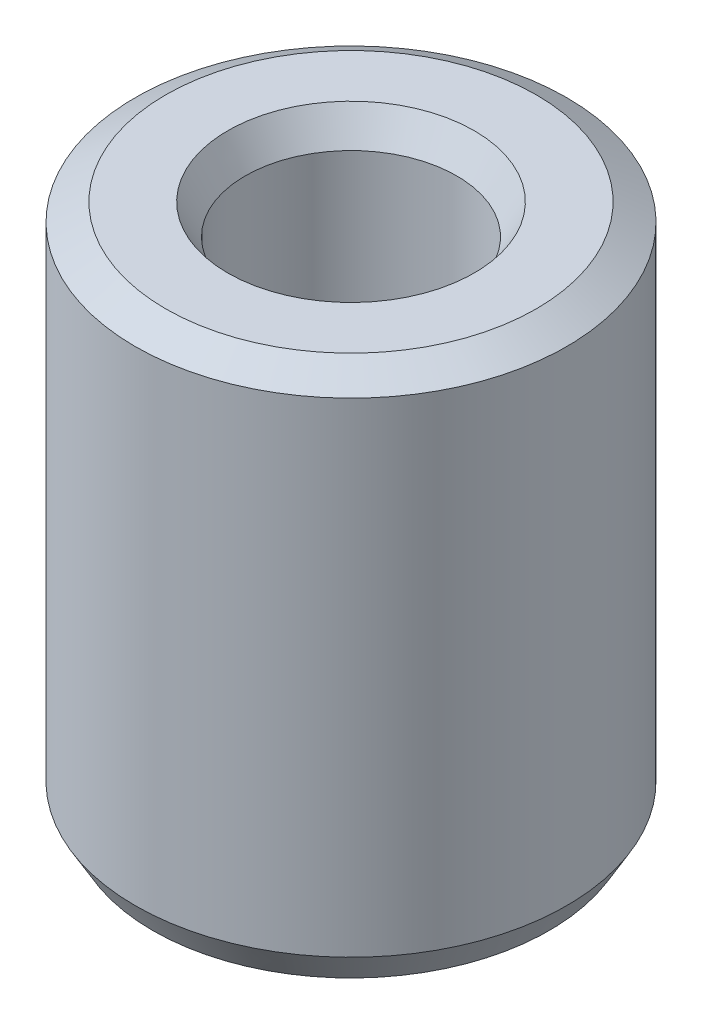
ISO-10303-21;
HEADER;
FILE_DESCRIPTION(('STEP AP214'),'2;1');
FILE_NAME('part.step','',(''),(''),'','','');
FILE_SCHEMA(('AUTOMOTIVE_DESIGN { 1 0 10303 214 1 1 1 1 }'));
ENDSEC;
DATA;
#1=APPLICATION_CONTEXT('core data for automotive mechanical design processes');
#2=APPLICATION_PROTOCOL_DEFINITION('international standard','automotive_design',2000,#1);
#3=PRODUCT_CONTEXT('',#1,'mechanical');
#4=PRODUCT('Part','Part','',(#3));
#5=PRODUCT_RELATED_PRODUCT_CATEGORY('part','',(#4));
#6=PRODUCT_DEFINITION_FORMATION('','',#4);
#7=PRODUCT_DEFINITION_CONTEXT('part definition',#1,'design');
#8=PRODUCT_DEFINITION('design','',#6,#7);
#9=PRODUCT_DEFINITION_SHAPE('','',#8);
#10=(LENGTH_UNIT() NAMED_UNIT(*) SI_UNIT(.MILLI.,.METRE.));
#11=(NAMED_UNIT(*) PLANE_ANGLE_UNIT() SI_UNIT($,.RADIAN.));
#12=(NAMED_UNIT(*) SI_UNIT($,.STERADIAN.) SOLID_ANGLE_UNIT());
#13=UNCERTAINTY_MEASURE_WITH_UNIT(LENGTH_MEASURE(1.E-05),#10,'distance_accuracy_value','');
#14=(GEOMETRIC_REPRESENTATION_CONTEXT(3) GLOBAL_UNCERTAINTY_ASSIGNED_CONTEXT((#13)) GLOBAL_UNIT_ASSIGNED_CONTEXT((#10,
#11,#12)) REPRESENTATION_CONTEXT('',''));
#15=CARTESIAN_POINT('',(0.,0.,0.));
#16=DIRECTION('',(0.,0.,1.));
#17=DIRECTION('',(1.,0.,0.));
#18=AXIS2_PLACEMENT_3D('',#15,#16,#17);
#19=CARTESIAN_POINT('',(0.,74.0065154047486,0.));
#20=DIRECTION('',(0.,-1.,0.));
#21=DIRECTION('',(0.,0.,-1.));
#22=AXIS2_PLACEMENT_3D('',#19,#20,#21);
#23=CYLINDRICAL_SURFACE('',#22,30.);
#24=CARTESIAN_POINT('',(0.,4.22138950589247,0.));
#25=DIRECTION('',(0.,1.,0.));
#26=DIRECTION('',(0.,0.,1.));
#27=AXIS2_PLACEMENT_3D('',#24,#25,#26);
#28=CIRCLE('',#27,30.);
#29=CARTESIAN_POINT('',(0.,4.22138950589247,30.));
#30=VERTEX_POINT('',#29);
#31=EDGE_CURVE('E10',#30,#30,#28,.T.);
#32=ORIENTED_EDGE('',*,*,#31,.T.);
#33=EDGE_LOOP('',(#32));
#34=FACE_BOUND('',#33,.T.);
#35=CARTESIAN_POINT('',(0.,71.5692950371673,0.));
#36=DIRECTION('',(0.,1.,0.));
#37=DIRECTION('',(0.,0.,1.));
#38=AXIS2_PLACEMENT_3D('',#35,#36,#37);
#39=CIRCLE('',#38,30.);
#40=CARTESIAN_POINT('',(0.,71.5692950371673,-30.));
#41=VERTEX_POINT('',#40);
#42=EDGE_CURVE('E50',#41,#41,#39,.F.);
#43=ORIENTED_EDGE('',*,*,#42,.T.);
#44=EDGE_LOOP('',(#43));
#45=FACE_BOUND('',#44,.T.);
#46=ADVANCED_FACE('F39',(#34,#45),#23,.T.);
#47=CARTESIAN_POINT('',(0.,74.0065154047486,0.));
#48=DIRECTION('',(0.,1.,0.));
#49=DIRECTION('',(0.,0.,1.));
#50=AXIS2_PLACEMENT_3D('',#47,#48,#49);
#51=PLANE('',#50);
#52=CARTESIAN_POINT('',(0.,74.0065154047486,0.));
#53=DIRECTION('',(0.,1.,0.));
#54=DIRECTION('',(0.,0.,1.));
#55=AXIS2_PLACEMENT_3D('',#52,#53,#54);
#56=CIRCLE('',#55,17.1480499267233);
#57=CARTESIAN_POINT('',(0.,74.0065154047486,17.1480499267233));
#58=VERTEX_POINT('',#57);
#59=EDGE_CURVE('E58',#58,#58,#56,.F.);
#60=ORIENTED_EDGE('',*,*,#59,.T.);
#61=EDGE_LOOP('',(#60));
#62=FACE_BOUND('',#61,.T.);
#63=CARTESIAN_POINT('',(0.,74.0065154047486,0.));
#64=DIRECTION('',(0.,1.,0.));
#65=DIRECTION('',(0.,0.,1.));
#66=AXIS2_PLACEMENT_3D('',#63,#64,#65);
#67=CIRCLE('',#66,25.7786104941075);
#68=CARTESIAN_POINT('',(0.,74.0065154047486,-25.7786104941075));
#69=VERTEX_POINT('',#68);
#70=EDGE_CURVE('E61',#69,#69,#67,.T.);
#71=ORIENTED_EDGE('',*,*,#70,.T.);
#72=EDGE_LOOP('',(#71));
#73=FACE_BOUND('',#72,.T.);
#74=ADVANCED_FACE('F88',(#62,#73),#51,.T.);
#75=CARTESIAN_POINT('',(0.,0.,0.));
#76=DIRECTION('',(0.,1.,0.));
#77=DIRECTION('',(0.,0.,1.));
#78=AXIS2_PLACEMENT_3D('',#75,#76,#77);
#79=PLANE('',#78);
#80=CARTESIAN_POINT('',(0.,0.,0.));
#81=DIRECTION('',(0.,1.,0.));
#82=DIRECTION('',(0.,0.,1.));
#83=AXIS2_PLACEMENT_3D('',#80,#81,#82);
#84=CIRCLE('',#83,18.9322190650345);
#85=CARTESIAN_POINT('',(0.,0.,18.9322190650345));
#86=VERTEX_POINT('',#85);
#87=EDGE_CURVE('E51',#86,#86,#84,.T.);
#88=ORIENTED_EDGE('',*,*,#87,.T.);
#89=EDGE_LOOP('',(#88));
#90=FACE_BOUND('',#89,.T.);
#91=CARTESIAN_POINT('',(0.,0.,0.));
#92=DIRECTION('',(0.,1.,0.));
#93=DIRECTION('',(0.,0.,1.));
#94=AXIS2_PLACEMENT_3D('',#91,#92,#93);
#95=CIRCLE('',#94,27.5627796324187);
#96=CARTESIAN_POINT('',(0.,0.,27.5627796324187));
#97=VERTEX_POINT('',#96);
#98=EDGE_CURVE('E54',#97,#97,#95,.F.);
#99=ORIENTED_EDGE('',*,*,#98,.T.);
#100=EDGE_LOOP('',(#99));
#101=FACE_BOUND('',#100,.T.);
#102=ADVANCED_FACE('F83',(#90,#101),#79,.F.);
#103=CARTESIAN_POINT('',(0.,74.0065154047486,0.));
#104=DIRECTION('',(0.,-1.,0.));
#105=DIRECTION('',(0.,0.,-1.));
#106=AXIS2_PLACEMENT_3D('',#103,#104,#105);
#107=CYLINDRICAL_SURFACE('',#106,14.7108295591421);
#108=CARTESIAN_POINT('',(0.,69.7851258988562,0.));
#109=DIRECTION('',(0.,1.,0.));
#110=DIRECTION('',(0.,0.,1.));
#111=AXIS2_PLACEMENT_3D('',#108,#109,#110);
#112=CIRCLE('',#111,14.7108295591421);
#113=CARTESIAN_POINT('',(0.,69.7851258988562,14.7108295591421));
#114=VERTEX_POINT('',#113);
#115=EDGE_CURVE('E67',#114,#114,#112,.T.);
#116=ORIENTED_EDGE('',*,*,#115,.T.);
#117=EDGE_LOOP('',(#116));
#118=FACE_BOUND('',#117,.T.);
#119=CARTESIAN_POINT('',(0.,2.4372203675813,0.));
#120=DIRECTION('',(0.,1.,0.));
#121=DIRECTION('',(0.,0.,1.));
#122=AXIS2_PLACEMENT_3D('',#119,#120,#121);
#123=CIRCLE('',#122,14.7108295591421);
#124=CARTESIAN_POINT('',(0.,2.4372203675813,14.7108295591421));
#125=VERTEX_POINT('',#124);
#126=EDGE_CURVE('E69',#125,#125,#123,.F.);
#127=ORIENTED_EDGE('',*,*,#126,.T.);
#128=EDGE_LOOP('',(#127));
#129=FACE_BOUND('',#128,.T.);
#130=ADVANCED_FACE('F71',(#118,#129),#107,.F.);
#131=CARTESIAN_POINT('',(0.,69.7851258988562,0.));
#132=DIRECTION('',(0.,1.,0.));
#133=DIRECTION('',(0.,0.,1.));
#134=AXIS2_PLACEMENT_3D('',#131,#132,#133);
#135=CONICAL_SURFACE('',#134,14.7108295591421,0.523598775598304);
#136=ORIENTED_EDGE('',*,*,#59,.F.);
#137=EDGE_LOOP('',(#136));
#138=FACE_BOUND('',#137,.T.);
#139=ORIENTED_EDGE('',*,*,#115,.F.);
#140=EDGE_LOOP('',(#139));
#141=FACE_BOUND('',#140,.T.);
#142=ADVANCED_FACE('F77',(#138,#141),#135,.F.);
#143=CARTESIAN_POINT('',(0.,0.,0.));
#144=DIRECTION('',(0.,-1.,0.));
#145=DIRECTION('',(0.,0.,-1.));
#146=AXIS2_PLACEMENT_3D('',#143,#144,#145);
#147=CONICAL_SURFACE('',#146,18.9322190650345,1.04719755119659);
#148=ORIENTED_EDGE('',*,*,#126,.F.);
#149=EDGE_LOOP('',(#148));
#150=FACE_BOUND('',#149,.T.);
#151=ORIENTED_EDGE('',*,*,#87,.F.);
#152=EDGE_LOOP('',(#151));
#153=FACE_BOUND('',#152,.T.);
#154=ADVANCED_FACE('F73',(#150,#153),#147,.F.);
#155=CARTESIAN_POINT('',(0.,4.22138950589247,0.));
#156=DIRECTION('',(0.,1.,0.));
#157=DIRECTION('',(0.,0.,1.));
#158=AXIS2_PLACEMENT_3D('',#155,#156,#157);
#159=CONICAL_SURFACE('',#158,30.,0.523598775598303);
#160=ORIENTED_EDGE('',*,*,#98,.F.);
#161=EDGE_LOOP('',(#160));
#162=FACE_BOUND('',#161,.T.);
#163=ORIENTED_EDGE('',*,*,#31,.F.);
#164=EDGE_LOOP('',(#163));
#165=FACE_BOUND('',#164,.T.);
#166=ADVANCED_FACE('F76',(#162,#165),#159,.T.);
#167=CARTESIAN_POINT('',(0.,74.0065154047486,0.));
#168=DIRECTION('',(0.,-1.,0.));
#169=DIRECTION('',(0.,0.,-1.));
#170=AXIS2_PLACEMENT_3D('',#167,#168,#169);
#171=CONICAL_SURFACE('',#170,25.7786104941075,1.0471975511966);
#172=CARTESIAN_POINT('',(0.,71.5692950371673,-30.));
#173=CARTESIAN_POINT('',(0.,71.5946827493296,-29.956027192647));
#174=CARTESIAN_POINT('',(0.,71.6200704614919,-29.9120543852939));
#175=CARTESIAN_POINT('',(0.,71.6708458858165,-29.8241087705878));
#176=CARTESIAN_POINT('',(0.,71.6962335979788,-29.7801359632348));
#177=CARTESIAN_POINT('',(0.,71.7470090223034,-29.6921903485287));
#178=CARTESIAN_POINT('',(0.,71.7723967344657,-29.6482175411756));
#179=CARTESIAN_POINT('',(0.,71.8231721587903,-29.5602719264695));
#180=CARTESIAN_POINT('',(0.,71.8485598709526,-29.5162991191165));
#181=CARTESIAN_POINT('',(0.,71.8993352952772,-29.4283535044104));
#182=CARTESIAN_POINT('',(0.,71.9247230074396,-29.3843806970574));
#183=CARTESIAN_POINT('',(0.,71.9754984317642,-29.2964350823513));
#184=CARTESIAN_POINT('',(0.,72.0008861439265,-29.2524622749982));
#185=CARTESIAN_POINT('',(0.,72.0516615682511,-29.1645166602921));
#186=CARTESIAN_POINT('',(0.,72.0770492804134,-29.1205438529391));
#187=CARTESIAN_POINT('',(0.,72.127824704738,-29.032598238233));
#188=CARTESIAN_POINT('',(0.,72.1532124169003,-28.9886254308799));
#189=CARTESIAN_POINT('',(0.,72.2039878412249,-28.9006798161738));
#190=CARTESIAN_POINT('',(0.,72.2293755533872,-28.8567070088208));
#191=CARTESIAN_POINT('',(0.,72.2801509777118,-28.7687613941147));
#192=CARTESIAN_POINT('',(0.,72.3055386898741,-28.7247885867617));
#193=CARTESIAN_POINT('',(0.,72.3563141141987,-28.6368429720556));
#194=CARTESIAN_POINT('',(0.,72.381701826361,-28.5928701647025));
#195=CARTESIAN_POINT('',(0.,72.4324772506857,-28.5049245499964));
#196=CARTESIAN_POINT('',(0.,72.457864962848,-28.4609517426434));
#197=CARTESIAN_POINT('',(0.,72.5086403871726,-28.3730061279373));
#198=CARTESIAN_POINT('',(0.,72.5340280993349,-28.3290333205842));
#199=CARTESIAN_POINT('',(0.,72.5848035236595,-28.2410877058781));
#200=CARTESIAN_POINT('',(0.,72.6101912358218,-28.1971148985251));
#201=CARTESIAN_POINT('',(0.,72.6609666601464,-28.109169283819));
#202=CARTESIAN_POINT('',(0.,72.6863543723087,-28.065196476466));
#203=CARTESIAN_POINT('',(0.,72.7371297966333,-27.9772508617599));
#204=CARTESIAN_POINT('',(0.,72.7625175087956,-27.9332780544068));
#205=CARTESIAN_POINT('',(0.,72.8132929331202,-27.8453324397007));
#206=CARTESIAN_POINT('',(0.,72.8386806452825,-27.8013596323477));
#207=CARTESIAN_POINT('',(0.,72.8894560696071,-27.7134140176416));
#208=CARTESIAN_POINT('',(0.,72.9148437817694,-27.6694412102885));
#209=CARTESIAN_POINT('',(0.,72.965619206094,-27.5814955955824));
#210=CARTESIAN_POINT('',(0.,72.9910069182564,-27.5375227882294));
#211=CARTESIAN_POINT('',(0.,73.041782342581,-27.4495771735233));
#212=CARTESIAN_POINT('',(0.,73.0671700547433,-27.4056043661703));
#213=CARTESIAN_POINT('',(0.,73.1179454790679,-27.3176587514642));
#214=CARTESIAN_POINT('',(0.,73.1433331912302,-27.2736859441111));
#215=CARTESIAN_POINT('',(0.,73.1941086155548,-27.185740329405));
#216=CARTESIAN_POINT('',(0.,73.2194963277171,-27.141767522052));
#217=CARTESIAN_POINT('',(0.,73.2702717520417,-27.0538219073459));
#218=CARTESIAN_POINT('',(0.,73.295659464204,-27.0098490999928));
#219=CARTESIAN_POINT('',(0.,73.3464348885286,-26.9219034852868));
#220=CARTESIAN_POINT('',(0.,73.3718226006909,-26.8779306779337));
#221=CARTESIAN_POINT('',(0.,73.4225980250155,-26.7899850632276));
#222=CARTESIAN_POINT('',(0.,73.4479857371779,-26.7460122558746));
#223=CARTESIAN_POINT('',(0.,73.4987611615025,-26.6580666411685));
#224=CARTESIAN_POINT('',(0.,73.5241488736648,-26.6140938338154));
#225=CARTESIAN_POINT('',(0.,73.5749242979894,-26.5261482191093));
#226=CARTESIAN_POINT('',(0.,73.6003120101517,-26.4821754117563));
#227=CARTESIAN_POINT('',(0.,73.6510874344763,-26.3942297970502));
#228=CARTESIAN_POINT('',(0.,73.6764751466386,-26.3502569896971));
#229=CARTESIAN_POINT('',(0.,73.7272505709632,-26.2623113749911));
#230=CARTESIAN_POINT('',(0.,73.7526382831255,-26.218338567638));
#231=CARTESIAN_POINT('',(0.,73.8034137074501,-26.1303929529319));
#232=CARTESIAN_POINT('',(0.,73.8288014196124,-26.0864201455789));
#233=CARTESIAN_POINT('',(0.,73.879576843937,-25.9984745308728));
#234=CARTESIAN_POINT('',(0.,73.9049645560993,-25.9545017235197));
#235=CARTESIAN_POINT('',(0.,73.955739980424,-25.8665561088136));
#236=CARTESIAN_POINT('',(0.,73.9811276925863,-25.8225833014606));
#237=CARTESIAN_POINT('',(0.,74.0065154047486,-25.7786104941075));
#238=B_SPLINE_CURVE_WITH_KNOTS('',3,(#172,#173,#174,#175,#176,#177,#178,#179,#180,#181,#182,
#183,#184,#185,#186,#187,#188,#189,#190,#191,#192,#193,#194,#195,#196,#197,#198,#199,#200,#201,
#202,#203,#204,#205,#206,#207,#208,#209,#210,#211,#212,#213,#214,#215,#216,#217,#218,#219,#220,
#221,#222,#223,#224,#225,#226,#227,#228,#229,#230,#231,#232,#233,#234,#235,#236,#237),
.UNSPECIFIED.,.F.,.F.,(4,2,2,2,2,2,2,2,2,2,2,2,2,2,2,2,2,2,2,2,2,2,2,2,2,2,2,2,2,2,2,2,4),(0.,
0.152326272973827,0.304652545947656,0.45697881892149,0.609305091895317,0.761631364869151,
0.913957637842977,1.06628391081681,1.21861018379064,1.37093645676447,1.5232627297383,
1.67558900271213,1.82791527568596,1.98024154865979,2.13256782163362,2.28489409460745,
2.43722036758128,2.58954664055511,2.74187291352894,2.89419918650277,3.0465254594766,
3.19885173245043,3.35117800542426,3.50350427839809,3.65583055137192,3.80815682434575,
3.96048309731958,4.11280937029341,4.26513564326724,4.41746191624107,4.5697881892149,
4.72211446218873,4.87444073516257),.UNSPECIFIED.);
#239=EDGE_CURVE('BSEAM45',#41,#69,#238,.T.);
#240=ORIENTED_EDGE('',*,*,#42,.F.);
#241=ORIENTED_EDGE('',*,*,#70,.F.);
#242=ORIENTED_EDGE('',*,*,#239,.T.);
#243=ORIENTED_EDGE('',*,*,#239,.F.);
#244=EDGE_LOOP('',(#240,#242,#241,#243));
#245=FACE_BOUND('',#244,.T.);
#246=ADVANCED_FACE('F45',(#245),#171,.T.);
#247=CLOSED_SHELL('',(#46,#74,#102,#130,#142,#154,#166,#246));
#248=MANIFOLD_SOLID_BREP('B2',#247);
#249=ADVANCED_BREP_SHAPE_REPRESENTATION('',(#18,#248),#14);
#250=SHAPE_DEFINITION_REPRESENTATION(#9,#249);
ENDSEC;
END-ISO-10303-21;
